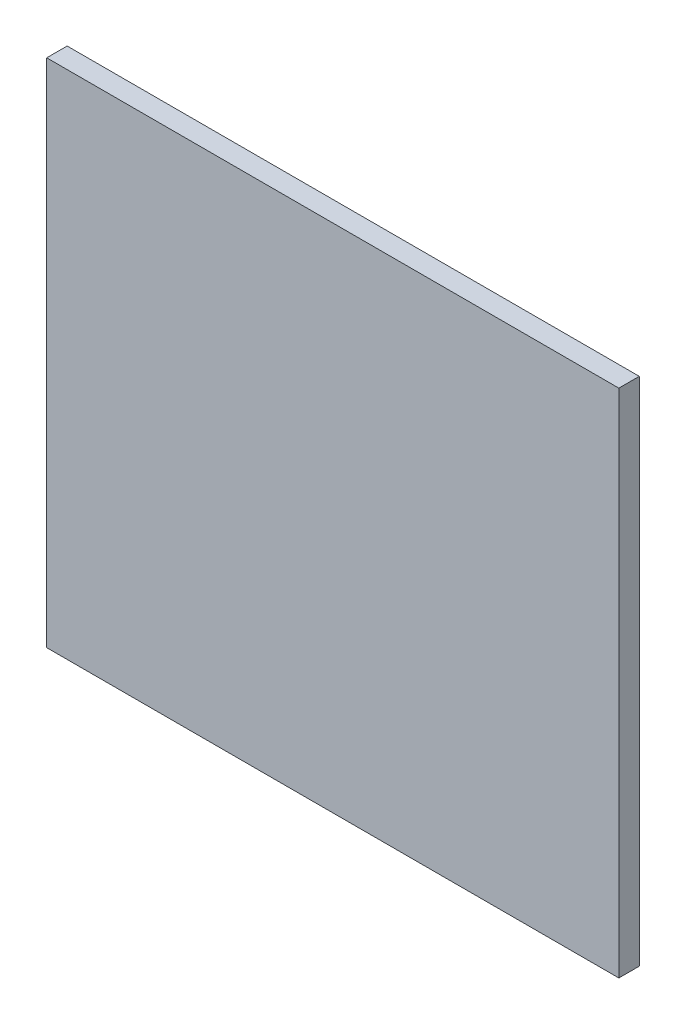
ISO-10303-21;
HEADER;
FILE_DESCRIPTION(('STEP AP214'),'2;1');
FILE_NAME('part.step','',(''),(''),'','','');
FILE_SCHEMA(('AUTOMOTIVE_DESIGN { 1 0 10303 214 1 1 1 1 }'));
ENDSEC;
DATA;
#1=APPLICATION_CONTEXT('core data for automotive mechanical design processes');
#2=APPLICATION_PROTOCOL_DEFINITION('international standard','automotive_design',2000,#1);
#3=PRODUCT_CONTEXT('',#1,'mechanical');
#4=PRODUCT('Part','Part','',(#3));
#5=PRODUCT_RELATED_PRODUCT_CATEGORY('part','',(#4));
#6=PRODUCT_DEFINITION_FORMATION('','',#4);
#7=PRODUCT_DEFINITION_CONTEXT('part definition',#1,'design');
#8=PRODUCT_DEFINITION('design','',#6,#7);
#9=PRODUCT_DEFINITION_SHAPE('','',#8);
#10=(LENGTH_UNIT() NAMED_UNIT(*) SI_UNIT(.MILLI.,.METRE.));
#11=(NAMED_UNIT(*) PLANE_ANGLE_UNIT() SI_UNIT($,.RADIAN.));
#12=(NAMED_UNIT(*) SI_UNIT($,.STERADIAN.) SOLID_ANGLE_UNIT());
#13=UNCERTAINTY_MEASURE_WITH_UNIT(LENGTH_MEASURE(1.E-05),#10,'distance_accuracy_value','');
#14=(GEOMETRIC_REPRESENTATION_CONTEXT(3) GLOBAL_UNCERTAINTY_ASSIGNED_CONTEXT((#13)) GLOBAL_UNIT_ASSIGNED_CONTEXT((#10,
#11,#12)) REPRESENTATION_CONTEXT('',''));
#15=CARTESIAN_POINT('',(0.,0.,0.));
#16=DIRECTION('',(0.,0.,1.));
#17=DIRECTION('',(1.,0.,0.));
#18=AXIS2_PLACEMENT_3D('',#15,#16,#17);
#19=CARTESIAN_POINT('',(0.,0.,0.6));
#20=DIRECTION('',(0.,0.,-1.));
#21=DIRECTION('',(-1.,0.,0.));
#22=AXIS2_PLACEMENT_3D('',#19,#20,#21);
#23=PLANE('',#22);
#24=DIRECTION('',(-1.,0.,0.));
#25=VECTOR('',#24,1.);
#26=CARTESIAN_POINT('',(0.699975956345425,-0.624999999999999,0.6));
#27=LINE('',#26,#25);
#28=CARTESIAN_POINT('',(0.699975956345425,-0.624999999999999,0.6));
#29=VERTEX_POINT('',#28);
#30=CARTESIAN_POINT('',(-0.699975956345425,-0.624999999999999,0.6));
#31=VERTEX_POINT('',#30);
#32=EDGE_CURVE('E11',#29,#31,#27,.T.);
#33=ORIENTED_EDGE('',*,*,#32,.T.);
#34=DIRECTION('',(0.,1.,0.));
#35=VECTOR('',#34,1.);
#36=CARTESIAN_POINT('',(-0.699975956345425,-0.624999999999999,0.6));
#37=LINE('',#36,#35);
#38=CARTESIAN_POINT('',(-0.699975956345425,0.624999999999999,0.6));
#39=VERTEX_POINT('',#38);
#40=EDGE_CURVE('E61',#31,#39,#37,.T.);
#41=ORIENTED_EDGE('',*,*,#40,.T.);
#42=DIRECTION('',(1.,0.,0.));
#43=VECTOR('',#42,1.);
#44=CARTESIAN_POINT('',(-0.699975956345425,0.624999999999999,0.6));
#45=LINE('',#44,#43);
#46=CARTESIAN_POINT('',(0.699975956345425,0.624999999999999,0.6));
#47=VERTEX_POINT('',#46);
#48=EDGE_CURVE('E84',#39,#47,#45,.T.);
#49=ORIENTED_EDGE('',*,*,#48,.T.);
#50=DIRECTION('',(0.,-1.,0.));
#51=VECTOR('',#50,1.);
#52=CARTESIAN_POINT('',(0.699975956345425,0.624999999999999,0.6));
#53=LINE('',#52,#51);
#54=EDGE_CURVE('E81',#47,#29,#53,.T.);
#55=ORIENTED_EDGE('',*,*,#54,.T.);
#56=EDGE_LOOP('',(#33,#41,#49,#55));
#57=FACE_BOUND('',#56,.T.);
#58=ADVANCED_FACE('F17',(#57),#23,.T.);
#59=CARTESIAN_POINT('',(-0.699975956345425,-0.875193445267577,0.650000000000001));
#60=DIRECTION('',(-1.,0.,0.));
#61=DIRECTION('',(0.,1.,0.));
#62=AXIS2_PLACEMENT_3D('',#59,#60,#61);
#63=PLANE('',#62);
#64=DIRECTION('',(0.,0.,1.));
#65=VECTOR('',#64,1.);
#66=CARTESIAN_POINT('',(-0.699975956345424,-0.625,0.6));
#67=LINE('',#66,#65);
#68=CARTESIAN_POINT('',(-0.699975956345425,-0.624999999999999,0.650000000000001));
#69=VERTEX_POINT('',#68);
#70=EDGE_CURVE('E24',#31,#69,#67,.T.);
#71=ORIENTED_EDGE('',*,*,#70,.T.);
#72=DIRECTION('',(0.,1.,0.));
#73=VECTOR('',#72,1.);
#74=CARTESIAN_POINT('',(-0.699975956345425,-0.624999999999999,0.650000000000001));
#75=LINE('',#74,#73);
#76=CARTESIAN_POINT('',(-0.699975956345425,0.624999999999999,0.650000000000001));
#77=VERTEX_POINT('',#76);
#78=EDGE_CURVE('E62',#69,#77,#75,.T.);
#79=ORIENTED_EDGE('',*,*,#78,.T.);
#80=DIRECTION('',(0.,0.,-1.));
#81=VECTOR('',#80,1.);
#82=CARTESIAN_POINT('',(-0.699975956345424,0.624999999999999,0.650000000000001));
#83=LINE('',#82,#81);
#84=EDGE_CURVE('E72',#77,#39,#83,.T.);
#85=ORIENTED_EDGE('',*,*,#84,.T.);
#86=ORIENTED_EDGE('',*,*,#40,.F.);
#87=EDGE_LOOP('',(#71,#79,#85,#86));
#88=FACE_BOUND('',#87,.T.);
#89=ADVANCED_FACE('F89',(#88),#63,.T.);
#90=CARTESIAN_POINT('',(0.699975956345425,0.875193445267577,0.650000000000001));
#91=DIRECTION('',(1.,0.,0.));
#92=DIRECTION('',(0.,-1.,0.));
#93=AXIS2_PLACEMENT_3D('',#90,#91,#92);
#94=PLANE('',#93);
#95=DIRECTION('',(0.,0.,-1.));
#96=VECTOR('',#95,1.);
#97=CARTESIAN_POINT('',(0.699975956345424,-0.624999999999999,0.650000000000001));
#98=LINE('',#97,#96);
#99=CARTESIAN_POINT('',(0.699975956345425,-0.624999999999999,0.650000000000001));
#100=VERTEX_POINT('',#99);
#101=EDGE_CURVE('E53',#100,#29,#98,.T.);
#102=ORIENTED_EDGE('',*,*,#101,.T.);
#103=ORIENTED_EDGE('',*,*,#54,.F.);
#104=DIRECTION('',(0.,0.,1.));
#105=VECTOR('',#104,1.);
#106=CARTESIAN_POINT('',(0.699975956345424,0.625,0.6));
#107=LINE('',#106,#105);
#108=CARTESIAN_POINT('',(0.699975956345425,0.624999999999999,0.650000000000001));
#109=VERTEX_POINT('',#108);
#110=EDGE_CURVE('E68',#47,#109,#107,.T.);
#111=ORIENTED_EDGE('',*,*,#110,.T.);
#112=DIRECTION('',(0.,-1.,0.));
#113=VECTOR('',#112,1.);
#114=CARTESIAN_POINT('',(0.699975956345425,0.624999999999999,0.650000000000001));
#115=LINE('',#114,#113);
#116=EDGE_CURVE('E65',#109,#100,#115,.T.);
#117=ORIENTED_EDGE('',*,*,#116,.T.);
#118=EDGE_LOOP('',(#102,#103,#111,#117));
#119=FACE_BOUND('',#118,.T.);
#120=ADVANCED_FACE('F66',(#119),#94,.T.);
#121=CARTESIAN_POINT('',(1.,0.624999999999999,0.));
#122=DIRECTION('',(0.,1.,0.));
#123=DIRECTION('',(-1.,0.,0.));
#124=AXIS2_PLACEMENT_3D('',#121,#122,#123);
#125=PLANE('',#124);
#126=ORIENTED_EDGE('',*,*,#110,.F.);
#127=ORIENTED_EDGE('',*,*,#48,.F.);
#128=ORIENTED_EDGE('',*,*,#84,.F.);
#129=DIRECTION('',(-1.,0.,0.));
#130=VECTOR('',#129,1.);
#131=CARTESIAN_POINT('',(0.699975956345425,0.624999999999999,0.650000000000001));
#132=LINE('',#131,#130);
#133=EDGE_CURVE('E73',#109,#77,#132,.T.);
#134=ORIENTED_EDGE('',*,*,#133,.F.);
#135=EDGE_LOOP('',(#126,#127,#128,#134));
#136=FACE_BOUND('',#135,.T.);
#137=ADVANCED_FACE('F91',(#136),#125,.T.);
#138=CARTESIAN_POINT('',(0.,0.,0.650000000000001));
#139=DIRECTION('',(0.,0.,1.));
#140=DIRECTION('',(1.,0.,0.));
#141=AXIS2_PLACEMENT_3D('',#138,#139,#140);
#142=PLANE('',#141);
#143=ORIENTED_EDGE('',*,*,#116,.F.);
#144=ORIENTED_EDGE('',*,*,#133,.T.);
#145=ORIENTED_EDGE('',*,*,#78,.F.);
#146=DIRECTION('',(1.,0.,0.));
#147=VECTOR('',#146,1.);
#148=CARTESIAN_POINT('',(-0.699975956345425,-0.624999999999999,0.650000000000001));
#149=LINE('',#148,#147);
#150=EDGE_CURVE('E57',#69,#100,#149,.T.);
#151=ORIENTED_EDGE('',*,*,#150,.T.);
#152=EDGE_LOOP('',(#143,#144,#145,#151));
#153=FACE_BOUND('',#152,.T.);
#154=ADVANCED_FACE('F75',(#153),#142,.T.);
#155=CARTESIAN_POINT('',(-1.,-0.624999999999999,0.));
#156=DIRECTION('',(0.,-1.,0.));
#157=DIRECTION('',(1.,0.,0.));
#158=AXIS2_PLACEMENT_3D('',#155,#156,#157);
#159=PLANE('',#158);
#160=ORIENTED_EDGE('',*,*,#101,.F.);
#161=ORIENTED_EDGE('',*,*,#150,.F.);
#162=ORIENTED_EDGE('',*,*,#70,.F.);
#163=ORIENTED_EDGE('',*,*,#32,.F.);
#164=EDGE_LOOP('',(#160,#161,#162,#163));
#165=FACE_BOUND('',#164,.T.);
#166=ADVANCED_FACE('F55',(#165),#159,.T.);
#167=CLOSED_SHELL('',(#58,#89,#120,#137,#154,#166));
#168=MANIFOLD_SOLID_BREP('B1',#167);
#169=ADVANCED_BREP_SHAPE_REPRESENTATION('',(#18,#168),#14);
#170=SHAPE_DEFINITION_REPRESENTATION(#9,#169);
ENDSEC;
END-ISO-10303-21;
